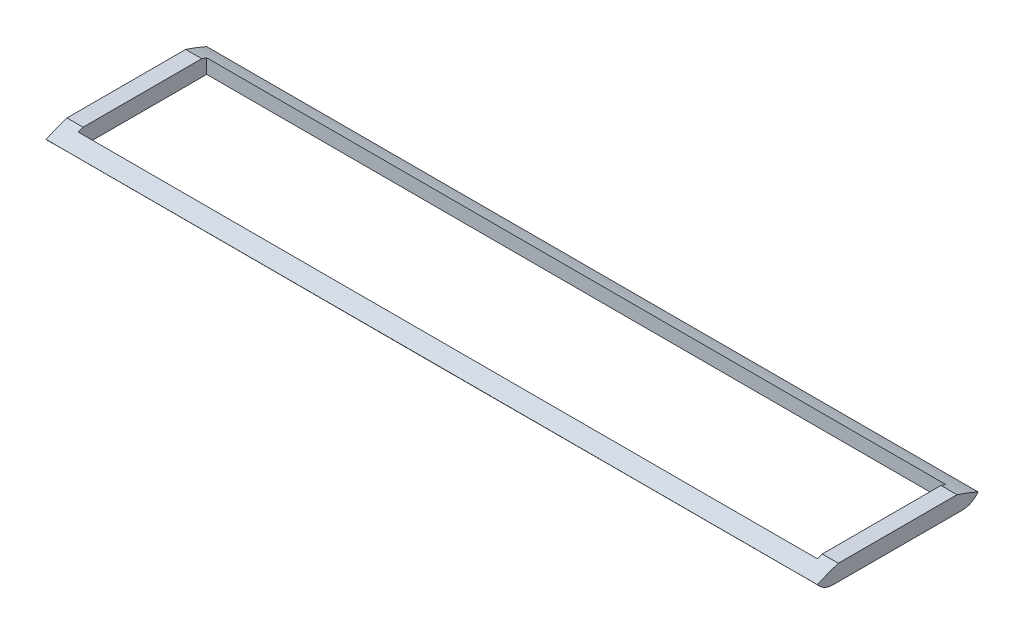
ISO-10303-21;
HEADER;
FILE_DESCRIPTION(('STEP AP214'),'2;1');
FILE_NAME('part.step','',(''),(''),'','','');
FILE_SCHEMA(('AUTOMOTIVE_DESIGN { 1 0 10303 214 1 1 1 1 }'));
ENDSEC;
DATA;
#1=APPLICATION_CONTEXT('core data for automotive mechanical design processes');
#2=APPLICATION_PROTOCOL_DEFINITION('international standard','automotive_design',2000,#1);
#3=PRODUCT_CONTEXT('',#1,'mechanical');
#4=PRODUCT('Part','Part','',(#3));
#5=PRODUCT_RELATED_PRODUCT_CATEGORY('part','',(#4));
#6=PRODUCT_DEFINITION_FORMATION('','',#4);
#7=PRODUCT_DEFINITION_CONTEXT('part definition',#1,'design');
#8=PRODUCT_DEFINITION('design','',#6,#7);
#9=PRODUCT_DEFINITION_SHAPE('','',#8);
#10=(LENGTH_UNIT() NAMED_UNIT(*) SI_UNIT(.MILLI.,.METRE.));
#11=(NAMED_UNIT(*) PLANE_ANGLE_UNIT() SI_UNIT($,.RADIAN.));
#12=(NAMED_UNIT(*) SI_UNIT($,.STERADIAN.) SOLID_ANGLE_UNIT());
#13=UNCERTAINTY_MEASURE_WITH_UNIT(LENGTH_MEASURE(1.E-05),#10,'distance_accuracy_value','');
#14=(GEOMETRIC_REPRESENTATION_CONTEXT(3) GLOBAL_UNCERTAINTY_ASSIGNED_CONTEXT((#13)) GLOBAL_UNIT_ASSIGNED_CONTEXT((#10,
#11,#12)) REPRESENTATION_CONTEXT('',''));
#15=CARTESIAN_POINT('',(0.,0.,0.));
#16=DIRECTION('',(0.,0.,1.));
#17=DIRECTION('',(1.,0.,0.));
#18=AXIS2_PLACEMENT_3D('',#15,#16,#17);
#19=CARTESIAN_POINT('',(0.,6.35,0.));
#20=DIRECTION('',(0.,-1.,0.));
#21=DIRECTION('',(0.,0.,-1.));
#22=AXIS2_PLACEMENT_3D('',#19,#20,#21);
#23=PLANE('',#22);
#24=DIRECTION('',(0.,0.,1.));
#25=VECTOR('',#24,1.);
#26=CARTESIAN_POINT('',(-152.4,6.35,31.75));
#27=LINE('',#26,#25);
#28=CARTESIAN_POINT('',(-152.4,6.35000000000919,-23.4489290315346));
#29=VERTEX_POINT('',#28);
#30=CARTESIAN_POINT('',(-152.4,6.35000000000919,23.4489290315346));
#31=VERTEX_POINT('',#30);
#32=EDGE_CURVE('E52',#29,#31,#27,.T.);
#33=ORIENTED_EDGE('',*,*,#32,.T.);
#34=DIRECTION('',(1.,0.,0.));
#35=VECTOR('',#34,1.);
#36=CARTESIAN_POINT('',(-152.4,6.35,23.4489290315628));
#37=LINE('',#36,#35);
#38=CARTESIAN_POINT('',(-146.05,6.35000000000919,23.4489290315346));
#39=VERTEX_POINT('',#38);
#40=EDGE_CURVE('E148',#31,#39,#37,.T.);
#41=ORIENTED_EDGE('',*,*,#40,.T.);
#42=DIRECTION('',(0.,0.,1.));
#43=VECTOR('',#42,1.);
#44=CARTESIAN_POINT('',(-146.05,6.35,25.4));
#45=LINE('',#44,#43);
#46=CARTESIAN_POINT('',(-146.05,6.35000000000919,-23.4489290315346));
#47=VERTEX_POINT('',#46);
#48=EDGE_CURVE('E252',#47,#39,#45,.T.);
#49=ORIENTED_EDGE('',*,*,#48,.F.);
#50=DIRECTION('',(1.,0.,0.));
#51=VECTOR('',#50,1.);
#52=CARTESIAN_POINT('',(-152.4,6.35,-23.4489290315629));
#53=LINE('',#52,#51);
#54=EDGE_CURVE('E220',#47,#29,#53,.F.);
#55=ORIENTED_EDGE('',*,*,#54,.T.);
#56=EDGE_LOOP('',(#33,#41,#49,#55));
#57=FACE_BOUND('',#56,.T.);
#58=ADVANCED_FACE('F43',(#57),#23,.F.);
#59=CARTESIAN_POINT('',(0.,0.,0.));
#60=DIRECTION('',(0.,-1.,0.));
#61=DIRECTION('',(0.,0.,-1.));
#62=AXIS2_PLACEMENT_3D('',#59,#60,#61);
#63=PLANE('',#62);
#64=DIRECTION('',(1.,0.,0.));
#65=VECTOR('',#64,1.);
#66=CARTESIAN_POINT('',(-152.4,0.,25.4));
#67=LINE('',#66,#65);
#68=CARTESIAN_POINT('',(-152.4,0.,25.4));
#69=VERTEX_POINT('',#68);
#70=CARTESIAN_POINT('',(-146.05,0.,25.4));
#71=VERTEX_POINT('',#70);
#72=EDGE_CURVE('E290',#69,#71,#67,.T.);
#73=ORIENTED_EDGE('',*,*,#72,.F.);
#74=DIRECTION('',(0.,0.,1.));
#75=VECTOR('',#74,1.);
#76=CARTESIAN_POINT('',(-152.4,0.,31.75));
#77=LINE('',#76,#75);
#78=CARTESIAN_POINT('',(-152.4,0.,-25.4));
#79=VERTEX_POINT('',#78);
#80=EDGE_CURVE('E159',#79,#69,#77,.T.);
#81=ORIENTED_EDGE('',*,*,#80,.F.);
#82=DIRECTION('',(1.,0.,0.));
#83=VECTOR('',#82,1.);
#84=CARTESIAN_POINT('',(-152.4,0.,-25.4));
#85=LINE('',#84,#83);
#86=CARTESIAN_POINT('',(-146.05,0.,-25.4));
#87=VERTEX_POINT('',#86);
#88=EDGE_CURVE('E295',#79,#87,#85,.T.);
#89=ORIENTED_EDGE('',*,*,#88,.T.);
#90=DIRECTION('',(0.,0.,1.));
#91=VECTOR('',#90,1.);
#92=CARTESIAN_POINT('',(-146.05,0.,25.4));
#93=LINE('',#92,#91);
#94=EDGE_CURVE('E265',#87,#71,#93,.T.);
#95=ORIENTED_EDGE('',*,*,#94,.T.);
#96=EDGE_LOOP('',(#73,#81,#89,#95));
#97=FACE_BOUND('',#96,.T.);
#98=ADVANCED_FACE('F205',(#97),#63,.T.);
#99=CARTESIAN_POINT('',(146.05,0.,25.4));
#100=VERTEX_POINT('',#99);
#101=CARTESIAN_POINT('',(152.4,0.,25.4));
#102=VERTEX_POINT('',#101);
#103=EDGE_CURVE('E292',#100,#102,#67,.T.);
#104=ORIENTED_EDGE('',*,*,#103,.F.);
#105=DIRECTION('',(0.,0.,-1.));
#106=VECTOR('',#105,1.);
#107=CARTESIAN_POINT('',(146.05,0.,25.4));
#108=LINE('',#107,#106);
#109=CARTESIAN_POINT('',(146.05,0.,-25.4));
#110=VERTEX_POINT('',#109);
#111=EDGE_CURVE('E258',#100,#110,#108,.T.);
#112=ORIENTED_EDGE('',*,*,#111,.T.);
#113=CARTESIAN_POINT('',(152.4,0.,-25.4));
#114=VERTEX_POINT('',#113);
#115=EDGE_CURVE('E298',#110,#114,#85,.T.);
#116=ORIENTED_EDGE('',*,*,#115,.T.);
#117=DIRECTION('',(0.,0.,-1.));
#118=VECTOR('',#117,1.);
#119=CARTESIAN_POINT('',(152.4,0.,31.75));
#120=LINE('',#119,#118);
#121=EDGE_CURVE('E229',#102,#114,#120,.T.);
#122=ORIENTED_EDGE('',*,*,#121,.F.);
#123=EDGE_LOOP('',(#104,#112,#116,#122));
#124=FACE_BOUND('',#123,.T.);
#125=ADVANCED_FACE('F203',(#124),#63,.T.);
#126=DIRECTION('',(0.,0.,-1.));
#127=VECTOR('',#126,1.);
#128=CARTESIAN_POINT('',(146.05,6.35,25.4));
#129=LINE('',#128,#127);
#130=CARTESIAN_POINT('',(146.05,6.35,23.4489290315346));
#131=VERTEX_POINT('',#130);
#132=CARTESIAN_POINT('',(146.05,6.35000000000919,-23.4489290315346));
#133=VERTEX_POINT('',#132);
#134=EDGE_CURVE('E248',#131,#133,#129,.T.);
#135=ORIENTED_EDGE('',*,*,#134,.F.);
#136=CARTESIAN_POINT('',(152.4,6.35000000000919,23.4489290315346));
#137=VERTEX_POINT('',#136);
#138=EDGE_CURVE('E59',#131,#137,#37,.T.);
#139=ORIENTED_EDGE('',*,*,#138,.T.);
#140=DIRECTION('',(0.,0.,-1.));
#141=VECTOR('',#140,1.);
#142=CARTESIAN_POINT('',(152.4,6.35,31.75));
#143=LINE('',#142,#141);
#144=CARTESIAN_POINT('',(152.4,6.35000000000919,-23.4489290315346));
#145=VERTEX_POINT('',#144);
#146=EDGE_CURVE('E222',#137,#145,#143,.T.);
#147=ORIENTED_EDGE('',*,*,#146,.T.);
#148=EDGE_CURVE('E281',#145,#133,#53,.F.);
#149=ORIENTED_EDGE('',*,*,#148,.T.);
#150=EDGE_LOOP('',(#135,#139,#147,#149));
#151=FACE_BOUND('',#150,.T.);
#152=ADVANCED_FACE('F200',(#151),#23,.F.);
#153=CARTESIAN_POINT('',(152.4,6.35,31.75));
#154=DIRECTION('',(-1.,0.,0.));
#155=DIRECTION('',(0.,0.,1.));
#156=AXIS2_PLACEMENT_3D('',#153,#154,#155);
#157=PLANE('',#156);
#158=ORIENTED_EDGE('',*,*,#121,.T.);
#159=CARTESIAN_POINT('',(152.4,3.175,-31.75));
#160=CARTESIAN_POINT('',(152.4,0.,-29.4618980189725));
#161=CARTESIAN_POINT('',(152.4,0.,-25.4));
#162=B_SPLINE_CURVE_WITH_KNOTS('',2,(#159,#160,#161),.UNSPECIFIED.,.F.,.F.,(3,3),(0.,1.),.UNSPECIFIED.);
#163=CARTESIAN_POINT('',(152.4,3.175,-31.75));
#164=VERTEX_POINT('',#163);
#165=EDGE_CURVE('E161',#164,#114,#162,.T.);
#166=ORIENTED_EDGE('',*,*,#165,.F.);
#167=CARTESIAN_POINT('',(152.4,3.17499999999998,31.75));
#168=CARTESIAN_POINT('',(152.4,17.145,0.));
#169=CARTESIAN_POINT('',(152.4,3.175,-31.75));
#170=B_SPLINE_CURVE_WITH_KNOTS('',2,(#167,#168,#169),.UNSPECIFIED.,.F.,.F.,(3,3),(0.,1.),.UNSPECIFIED.);
#171=EDGE_CURVE('E331',#145,#164,#170,.T.);
#172=ORIENTED_EDGE('',*,*,#171,.F.);
#173=ORIENTED_EDGE('',*,*,#146,.F.);
#174=CARTESIAN_POINT('',(152.4,3.17499999999998,31.75));
#175=VERTEX_POINT('',#174);
#176=EDGE_CURVE('E166',#175,#137,#170,.T.);
#177=ORIENTED_EDGE('',*,*,#176,.F.);
#178=CARTESIAN_POINT('',(152.4,0.,25.4));
#179=CARTESIAN_POINT('',(152.4,0.,29.2166498948121));
#180=CARTESIAN_POINT('',(152.4,3.17499999999998,31.75));
#181=B_SPLINE_CURVE_WITH_KNOTS('',2,(#178,#179,#180),.UNSPECIFIED.,.F.,.F.,(3,3),(0.,1.),.UNSPECIFIED.);
#182=EDGE_CURVE('E138',#102,#175,#181,.T.);
#183=ORIENTED_EDGE('',*,*,#182,.F.);
#184=EDGE_LOOP('',(#158,#166,#172,#173,#177,#183));
#185=FACE_BOUND('',#184,.T.);
#186=ADVANCED_FACE('F45',(#185),#157,.F.);
#187=CARTESIAN_POINT('',(-152.4,6.35,31.75));
#188=DIRECTION('',(1.,0.,0.));
#189=DIRECTION('',(0.,0.,-1.));
#190=AXIS2_PLACEMENT_3D('',#187,#188,#189);
#191=PLANE('',#190);
#192=ORIENTED_EDGE('',*,*,#80,.T.);
#193=CARTESIAN_POINT('',(-152.4,0.,25.4));
#194=CARTESIAN_POINT('',(-152.4,0.,29.2166498948121));
#195=CARTESIAN_POINT('',(-152.4,3.17499999999998,31.75));
#196=B_SPLINE_CURVE_WITH_KNOTS('',2,(#193,#194,#195),.UNSPECIFIED.,.F.,.F.,(3,3),(0.,1.),.UNSPECIFIED.);
#197=CARTESIAN_POINT('',(-152.4,3.17499999999998,31.75));
#198=VERTEX_POINT('',#197);
#199=EDGE_CURVE('E135',#69,#198,#196,.T.);
#200=ORIENTED_EDGE('',*,*,#199,.T.);
#201=CARTESIAN_POINT('',(-152.4,3.17499999999998,31.75));
#202=CARTESIAN_POINT('',(-152.4,17.145,0.));
#203=CARTESIAN_POINT('',(-152.4,3.175,-31.75));
#204=B_SPLINE_CURVE_WITH_KNOTS('',2,(#201,#202,#203),.UNSPECIFIED.,.F.,.F.,(3,3),(0.,1.),.UNSPECIFIED.);
#205=EDGE_CURVE('E145',#198,#31,#204,.T.);
#206=ORIENTED_EDGE('',*,*,#205,.T.);
#207=ORIENTED_EDGE('',*,*,#32,.F.);
#208=CARTESIAN_POINT('',(-152.4,3.175,-31.75));
#209=VERTEX_POINT('',#208);
#210=EDGE_CURVE('E153',#29,#209,#204,.T.);
#211=ORIENTED_EDGE('',*,*,#210,.T.);
#212=CARTESIAN_POINT('',(-152.4,3.175,-31.75));
#213=CARTESIAN_POINT('',(-152.4,0.,-29.4618980189725));
#214=CARTESIAN_POINT('',(-152.4,0.,-25.4));
#215=B_SPLINE_CURVE_WITH_KNOTS('',2,(#212,#213,#214),.UNSPECIFIED.,.F.,.F.,(3,3),(0.,1.),.UNSPECIFIED.);
#216=EDGE_CURVE('E142',#209,#79,#215,.T.);
#217=ORIENTED_EDGE('',*,*,#216,.T.);
#218=EDGE_LOOP('',(#192,#200,#206,#207,#211,#217));
#219=FACE_BOUND('',#218,.T.);
#220=ADVANCED_FACE('F156',(#219),#191,.F.);
#221=CARTESIAN_POINT('',(-146.05,6.35,25.4));
#222=DIRECTION('',(1.,0.,0.));
#223=DIRECTION('',(0.,0.,-1.));
#224=AXIS2_PLACEMENT_3D('',#221,#222,#223);
#225=PLANE('',#224);
#226=CARTESIAN_POINT('',(-146.05,3.17499999999998,31.75));
#227=CARTESIAN_POINT('',(-146.05,17.145,0.));
#228=CARTESIAN_POINT('',(-146.05,3.175,-31.75));
#229=B_SPLINE_CURVE_WITH_KNOTS('',2,(#226,#227,#228),.UNSPECIFIED.,.F.,.F.,(3,3),(0.,1.),.UNSPECIFIED.);
#230=CARTESIAN_POINT('',(-146.05,5.68959999999999,25.4));
#231=VERTEX_POINT('',#230);
#232=EDGE_CURVE('E273',#231,#39,#229,.T.);
#233=ORIENTED_EDGE('',*,*,#232,.F.);
#234=DIRECTION('',(0.,-1.,0.));
#235=VECTOR('',#234,1.);
#236=CARTESIAN_POINT('',(-146.05,6.35,25.4));
#237=LINE('',#236,#235);
#238=EDGE_CURVE('E232',#231,#71,#237,.T.);
#239=ORIENTED_EDGE('',*,*,#238,.T.);
#240=ORIENTED_EDGE('',*,*,#94,.F.);
#241=DIRECTION('',(0.,-1.,0.));
#242=VECTOR('',#241,1.);
#243=CARTESIAN_POINT('',(-146.05,6.35,-25.4));
#244=LINE('',#243,#242);
#245=CARTESIAN_POINT('',(-146.05,5.6896,-25.4));
#246=VERTEX_POINT('',#245);
#247=EDGE_CURVE('E244',#246,#87,#244,.T.);
#248=ORIENTED_EDGE('',*,*,#247,.F.);
#249=EDGE_CURVE('E66',#47,#246,#229,.T.);
#250=ORIENTED_EDGE('',*,*,#249,.F.);
#251=ORIENTED_EDGE('',*,*,#48,.T.);
#252=EDGE_LOOP('',(#233,#239,#240,#248,#250,#251));
#253=FACE_BOUND('',#252,.T.);
#254=ADVANCED_FACE('F195',(#253),#225,.T.);
#255=CARTESIAN_POINT('',(-146.05,6.35,25.4));
#256=DIRECTION('',(0.,0.,-1.));
#257=DIRECTION('',(-1.,0.,0.));
#258=AXIS2_PLACEMENT_3D('',#255,#256,#257);
#259=PLANE('',#258);
#260=DIRECTION('',(1.,0.,0.));
#261=VECTOR('',#260,1.);
#262=CARTESIAN_POINT('',(-152.4,5.68959999999999,25.4));
#263=LINE('',#262,#261);
#264=CARTESIAN_POINT('',(146.05,5.68959999999999,25.4));
#265=VERTEX_POINT('',#264);
#266=EDGE_CURVE('E275',#265,#231,#263,.F.);
#267=ORIENTED_EDGE('',*,*,#266,.F.);
#268=DIRECTION('',(0.,-1.,0.));
#269=VECTOR('',#268,1.);
#270=CARTESIAN_POINT('',(146.05,6.35,25.4));
#271=LINE('',#270,#269);
#272=EDGE_CURVE('E237',#265,#100,#271,.T.);
#273=ORIENTED_EDGE('',*,*,#272,.T.);
#274=DIRECTION('',(1.,0.,0.));
#275=VECTOR('',#274,1.);
#276=CARTESIAN_POINT('',(-146.05,0.,25.4));
#277=LINE('',#276,#275);
#278=EDGE_CURVE('E262',#71,#100,#277,.T.);
#279=ORIENTED_EDGE('',*,*,#278,.F.);
#280=ORIENTED_EDGE('',*,*,#238,.F.);
#281=EDGE_LOOP('',(#267,#273,#279,#280));
#282=FACE_BOUND('',#281,.T.);
#283=ADVANCED_FACE('F191',(#282),#259,.T.);
#284=CARTESIAN_POINT('',(146.05,6.35,25.4));
#285=DIRECTION('',(-1.,0.,0.));
#286=DIRECTION('',(0.,0.,1.));
#287=AXIS2_PLACEMENT_3D('',#284,#285,#286);
#288=PLANE('',#287);
#289=CARTESIAN_POINT('',(146.05,3.17499999999998,31.75));
#290=CARTESIAN_POINT('',(146.05,17.145,0.));
#291=CARTESIAN_POINT('',(146.05,3.175,-31.75));
#292=B_SPLINE_CURVE_WITH_KNOTS('',2,(#289,#290,#291),.UNSPECIFIED.,.F.,.F.,(3,3),(0.,1.),.UNSPECIFIED.);
#293=CARTESIAN_POINT('',(146.05,5.6896,-25.4));
#294=VERTEX_POINT('',#293);
#295=EDGE_CURVE('E283',#294,#133,#292,.F.);
#296=ORIENTED_EDGE('',*,*,#295,.F.);
#297=DIRECTION('',(0.,-1.,0.));
#298=VECTOR('',#297,1.);
#299=CARTESIAN_POINT('',(146.05,6.35,-25.4));
#300=LINE('',#299,#298);
#301=EDGE_CURVE('E240',#294,#110,#300,.T.);
#302=ORIENTED_EDGE('',*,*,#301,.T.);
#303=ORIENTED_EDGE('',*,*,#111,.F.);
#304=ORIENTED_EDGE('',*,*,#272,.F.);
#305=EDGE_CURVE('E278',#131,#265,#292,.F.);
#306=ORIENTED_EDGE('',*,*,#305,.F.);
#307=ORIENTED_EDGE('',*,*,#134,.T.);
#308=EDGE_LOOP('',(#296,#302,#303,#304,#306,#307));
#309=FACE_BOUND('',#308,.T.);
#310=ADVANCED_FACE('F187',(#309),#288,.T.);
#311=CARTESIAN_POINT('',(-146.05,6.35,-25.4));
#312=DIRECTION('',(0.,0.,1.));
#313=DIRECTION('',(1.,0.,0.));
#314=AXIS2_PLACEMENT_3D('',#311,#312,#313);
#315=PLANE('',#314);
#316=DIRECTION('',(1.,0.,0.));
#317=VECTOR('',#316,1.);
#318=CARTESIAN_POINT('',(-152.4,5.6896,-25.4));
#319=LINE('',#318,#317);
#320=EDGE_CURVE('E11',#246,#294,#319,.T.);
#321=ORIENTED_EDGE('',*,*,#320,.F.);
#322=ORIENTED_EDGE('',*,*,#247,.T.);
#323=DIRECTION('',(-1.,0.,0.));
#324=VECTOR('',#323,1.);
#325=CARTESIAN_POINT('',(-146.05,0.,-25.4));
#326=LINE('',#325,#324);
#327=EDGE_CURVE('E255',#110,#87,#326,.T.);
#328=ORIENTED_EDGE('',*,*,#327,.F.);
#329=ORIENTED_EDGE('',*,*,#301,.F.);
#330=EDGE_LOOP('',(#321,#322,#328,#329));
#331=FACE_BOUND('',#330,.T.);
#332=ADVANCED_FACE('F183',(#331),#315,.T.);
#333=DIRECTION('',(1.,0.,0.));
#334=VECTOR('',#333,1.);
#335=SURFACE_OF_LINEAR_EXTRUSION('',#204,#334);
#336=ORIENTED_EDGE('',*,*,#171,.T.);
#337=DIRECTION('',(1.,0.,0.));
#338=VECTOR('',#337,1.);
#339=CARTESIAN_POINT('',(-152.4,3.175,-31.75));
#340=LINE('',#339,#338);
#341=EDGE_CURVE('E141',#209,#164,#340,.T.);
#342=ORIENTED_EDGE('',*,*,#341,.F.);
#343=ORIENTED_EDGE('',*,*,#210,.F.);
#344=ORIENTED_EDGE('',*,*,#54,.F.);
#345=ORIENTED_EDGE('',*,*,#249,.T.);
#346=ORIENTED_EDGE('',*,*,#320,.T.);
#347=ORIENTED_EDGE('',*,*,#295,.T.);
#348=ORIENTED_EDGE('',*,*,#148,.F.);
#349=EDGE_LOOP('',(#336,#342,#343,#344,#345,#346,#347,#348));
#350=FACE_BOUND('',#349,.T.);
#351=ADVANCED_FACE('F186',(#350),#335,.F.);
#352=DIRECTION('',(1.,0.,0.));
#353=VECTOR('',#352,1.);
#354=SURFACE_OF_LINEAR_EXTRUSION('',#215,#353);
#355=ORIENTED_EDGE('',*,*,#165,.T.);
#356=ORIENTED_EDGE('',*,*,#115,.F.);
#357=ORIENTED_EDGE('',*,*,#327,.T.);
#358=ORIENTED_EDGE('',*,*,#88,.F.);
#359=ORIENTED_EDGE('',*,*,#216,.F.);
#360=ORIENTED_EDGE('',*,*,#341,.T.);
#361=EDGE_LOOP('',(#355,#356,#357,#358,#359,#360));
#362=FACE_BOUND('',#361,.T.);
#363=ADVANCED_FACE('F316',(#362),#354,.F.);
#364=ORIENTED_EDGE('',*,*,#205,.F.);
#365=DIRECTION('',(1.,0.,0.));
#366=VECTOR('',#365,1.);
#367=CARTESIAN_POINT('',(-152.4,3.17499999999998,31.75));
#368=LINE('',#367,#366);
#369=EDGE_CURVE('E131',#198,#175,#368,.T.);
#370=ORIENTED_EDGE('',*,*,#369,.T.);
#371=ORIENTED_EDGE('',*,*,#176,.T.);
#372=ORIENTED_EDGE('',*,*,#138,.F.);
#373=ORIENTED_EDGE('',*,*,#305,.T.);
#374=ORIENTED_EDGE('',*,*,#266,.T.);
#375=ORIENTED_EDGE('',*,*,#232,.T.);
#376=ORIENTED_EDGE('',*,*,#40,.F.);
#377=EDGE_LOOP('',(#364,#370,#371,#372,#373,#374,#375,#376));
#378=FACE_BOUND('',#377,.T.);
#379=ADVANCED_FACE('F146',(#378),#335,.F.);
#380=DIRECTION('',(1.,0.,0.));
#381=VECTOR('',#380,1.);
#382=SURFACE_OF_LINEAR_EXTRUSION('',#196,#381);
#383=ORIENTED_EDGE('',*,*,#182,.T.);
#384=ORIENTED_EDGE('',*,*,#369,.F.);
#385=ORIENTED_EDGE('',*,*,#199,.F.);
#386=ORIENTED_EDGE('',*,*,#72,.T.);
#387=ORIENTED_EDGE('',*,*,#278,.T.);
#388=ORIENTED_EDGE('',*,*,#103,.T.);
#389=EDGE_LOOP('',(#383,#384,#385,#386,#387,#388));
#390=FACE_BOUND('',#389,.T.);
#391=ADVANCED_FACE('F133',(#390),#382,.F.);
#392=CLOSED_SHELL('',(#58,#98,#125,#152,#186,#220,#254,#283,#310,#332,#351,#363,#379,#391));
#393=MANIFOLD_SOLID_BREP('B2',#392);
#394=ADVANCED_BREP_SHAPE_REPRESENTATION('',(#18,#393),#14);
#395=SHAPE_DEFINITION_REPRESENTATION(#9,#394);
ENDSEC;
END-ISO-10303-21;
